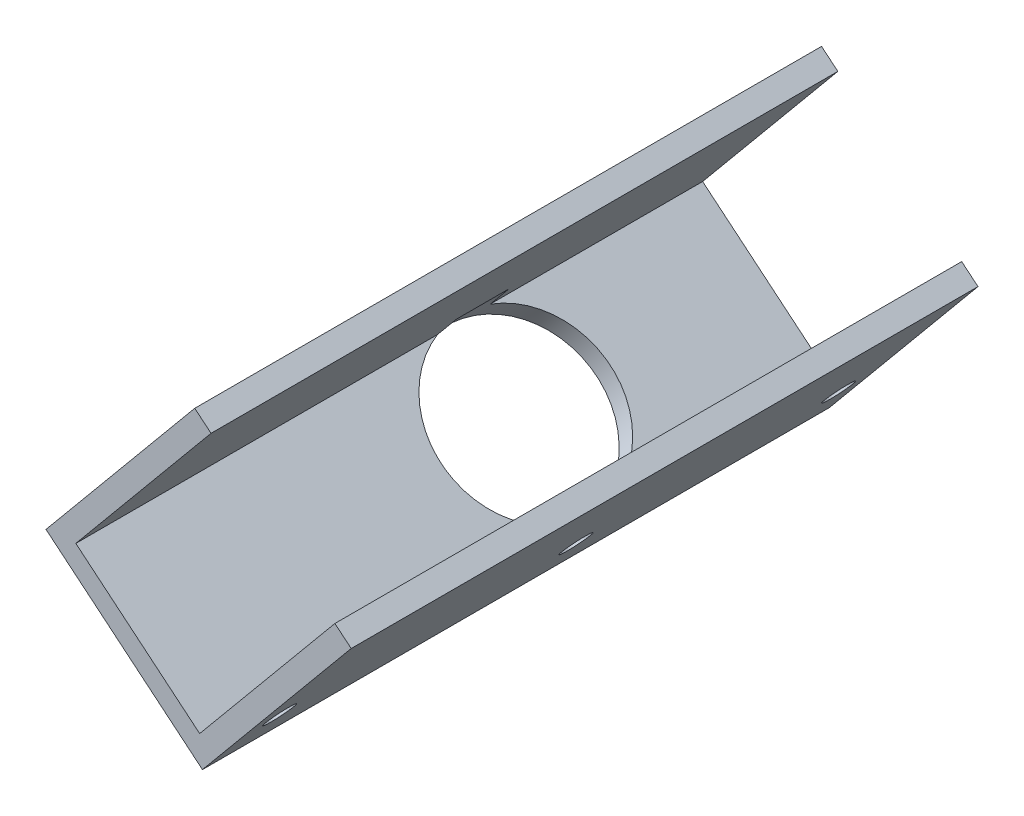
ISO-10303-21;
HEADER;
FILE_DESCRIPTION(('STEP AP214'),'2;1');
FILE_NAME('part.step','',(''),(''),'','','');
FILE_SCHEMA(('AUTOMOTIVE_DESIGN { 1 0 10303 214 1 1 1 1 }'));
ENDSEC;
DATA;
#1=APPLICATION_CONTEXT('core data for automotive mechanical design processes');
#2=APPLICATION_PROTOCOL_DEFINITION('international standard','automotive_design',2000,#1);
#3=PRODUCT_CONTEXT('',#1,'mechanical');
#4=PRODUCT('Part','Part','',(#3));
#5=PRODUCT_RELATED_PRODUCT_CATEGORY('part','',(#4));
#6=PRODUCT_DEFINITION_FORMATION('','',#4);
#7=PRODUCT_DEFINITION_CONTEXT('part definition',#1,'design');
#8=PRODUCT_DEFINITION('design','',#6,#7);
#9=PRODUCT_DEFINITION_SHAPE('','',#8);
#10=(LENGTH_UNIT() NAMED_UNIT(*) SI_UNIT(.MILLI.,.METRE.));
#11=(NAMED_UNIT(*) PLANE_ANGLE_UNIT() SI_UNIT($,.RADIAN.));
#12=(NAMED_UNIT(*) SI_UNIT($,.STERADIAN.) SOLID_ANGLE_UNIT());
#13=UNCERTAINTY_MEASURE_WITH_UNIT(LENGTH_MEASURE(1.E-05),#10,'distance_accuracy_value','');
#14=(GEOMETRIC_REPRESENTATION_CONTEXT(3) GLOBAL_UNCERTAINTY_ASSIGNED_CONTEXT((#13)) GLOBAL_UNIT_ASSIGNED_CONTEXT((#10,
#11,#12)) REPRESENTATION_CONTEXT('',''));
#15=CARTESIAN_POINT('',(0.,0.,0.));
#16=DIRECTION('',(0.,0.,1.));
#17=DIRECTION('',(1.,0.,0.));
#18=AXIS2_PLACEMENT_3D('',#15,#16,#17);
#19=CARTESIAN_POINT('',(-14.6219806697099,12.1325051532909,-37.));
#20=DIRECTION('',(-0.638552902804786,-0.76957792998473,0.));
#21=DIRECTION('',(0.76957792998473,-0.638552902804786,0.));
#22=AXIS2_PLACEMENT_3D('',#19,#20,#21);
#23=PLANE('',#22);
#24=DIRECTION('',(0.,0.,1.));
#25=VECTOR('',#24,1.);
#26=CARTESIAN_POINT('',(0.,0.,-37.));
#27=LINE('',#26,#25);
#28=CARTESIAN_POINT('',(0.,0.,-5.68906456410955));
#29=VERTEX_POINT('',#28);
#30=CARTESIAN_POINT('',(0.,0.,37.));
#31=VERTEX_POINT('',#30);
#32=EDGE_CURVE('E169',#29,#31,#27,.T.);
#33=ORIENTED_EDGE('',*,*,#32,.F.);
#34=CARTESIAN_POINT('',(-7.31099033485493,6.06625257664547,-8.81156356330876));
#35=DIRECTION('',(-0.638552902804786,-0.76957792998473,0.));
#36=DIRECTION('',(0.76957792998473,-0.638552902804786,0.));
#37=AXIS2_PLACEMENT_3D('',#34,#35,#36);
#38=CIRCLE('',#37,10.);
#39=CARTESIAN_POINT('',(-14.6219806697099,12.1325051532909,-5.68906456410954));
#40=VERTEX_POINT('',#39);
#41=EDGE_CURVE('E197',#29,#40,#38,.T.);
#42=ORIENTED_EDGE('',*,*,#41,.T.);
#43=DIRECTION('',(0.,0.,1.));
#44=VECTOR('',#43,1.);
#45=CARTESIAN_POINT('',(-14.6219806697099,12.1325051532909,-37.));
#46=LINE('',#45,#44);
#47=CARTESIAN_POINT('',(-14.6219806697099,12.1325051532909,37.));
#48=VERTEX_POINT('',#47);
#49=EDGE_CURVE('E182',#40,#48,#46,.T.);
#50=ORIENTED_EDGE('',*,*,#49,.T.);
#51=DIRECTION('',(0.76957792998473,-0.638552902804786,0.));
#52=VECTOR('',#51,1.);
#53=CARTESIAN_POINT('',(-14.6219806697099,12.1325051532909,37.));
#54=LINE('',#53,#52);
#55=EDGE_CURVE('E200',#48,#31,#54,.T.);
#56=ORIENTED_EDGE('',*,*,#55,.T.);
#57=EDGE_LOOP('',(#33,#42,#50,#56));
#58=FACE_BOUND('',#57,.T.);
#59=ADVANCED_FACE('F40',(#58),#23,.F.);
#60=CARTESIAN_POINT('',(1.92394482496182,-1.59638225701197,-37.));
#61=DIRECTION('',(0.76957792998473,-0.638552902804786,0.));
#62=DIRECTION('',(0.638552902804786,0.76957792998473,0.));
#63=AXIS2_PLACEMENT_3D('',#60,#61,#62);
#64=PLANE('',#63);
#65=DIRECTION('',(0.,0.,-1.));
#66=VECTOR('',#65,1.);
#67=CARTESIAN_POINT('',(17.8877673950815,17.6430659926063,-37.));
#68=LINE('',#67,#66);
#69=CARTESIAN_POINT('',(17.8877673950815,17.6430659926063,37.));
#70=VERTEX_POINT('',#69);
#71=CARTESIAN_POINT('',(17.8877673950815,17.6430659926063,-37.));
#72=VERTEX_POINT('',#71);
#73=EDGE_CURVE('E127',#70,#72,#68,.T.);
#74=ORIENTED_EDGE('',*,*,#73,.F.);
#75=DIRECTION('',(0.638552902804786,0.76957792998473,0.));
#76=VECTOR('',#75,1.);
#77=CARTESIAN_POINT('',(1.92394482496182,-1.59638225701197,37.));
#78=LINE('',#77,#76);
#79=CARTESIAN_POINT('',(0.327562567949858,-3.52032708197379,37.));
#80=VERTEX_POINT('',#79);
#81=EDGE_CURVE('E138',#80,#70,#78,.T.);
#82=ORIENTED_EDGE('',*,*,#81,.F.);
#83=DIRECTION('',(0.,0.,1.));
#84=VECTOR('',#83,1.);
#85=CARTESIAN_POINT('',(0.327562567949858,-3.52032708197379,-37.));
#86=LINE('',#85,#84);
#87=CARTESIAN_POINT('',(0.327562567949858,-3.52032708197379,-37.));
#88=VERTEX_POINT('',#87);
#89=EDGE_CURVE('E170',#88,#80,#86,.T.);
#90=ORIENTED_EDGE('',*,*,#89,.F.);
#91=DIRECTION('',(0.638552902804786,0.76957792998473,0.));
#92=VECTOR('',#91,1.);
#93=CARTESIAN_POINT('',(1.92394482496182,-1.59638225701197,-37.));
#94=LINE('',#93,#92);
#95=EDGE_CURVE('E140',#88,#72,#94,.T.);
#96=ORIENTED_EDGE('',*,*,#95,.T.);
#97=EDGE_LOOP('',(#74,#82,#90,#96));
#98=FACE_BOUND('',#97,.T.);
#99=CARTESIAN_POINT('',(5.43598579038817,2.63629635790407,33.0000000000001));
#100=DIRECTION('',(0.76957792998473,-0.638552902804786,0.));
#101=DIRECTION('',(0.638552902804786,0.76957792998473,0.));
#102=AXIS2_PLACEMENT_3D('',#99,#100,#101);
#103=CIRCLE('',#102,1.69999999999999);
#104=CARTESIAN_POINT('',(6.5215257251563,3.9445788388781,33.0000000000001));
#105=VERTEX_POINT('',#104);
#106=EDGE_CURVE('E241',#105,#105,#103,.T.);
#107=ORIENTED_EDGE('',*,*,#106,.F.);
#108=EDGE_LOOP('',(#107));
#109=FACE_BOUND('',#108,.T.);
#110=CARTESIAN_POINT('',(5.43598579038815,2.63629635790404,-32.9999999999999));
#111=DIRECTION('',(0.76957792998473,-0.638552902804786,0.));
#112=DIRECTION('',(0.638552902804786,0.76957792998473,0.));
#113=AXIS2_PLACEMENT_3D('',#110,#111,#112);
#114=CIRCLE('',#113,1.69999999999999);
#115=CARTESIAN_POINT('',(6.52152572515628,3.94457883887808,-32.9999999999999));
#116=VERTEX_POINT('',#115);
#117=EDGE_CURVE('E238',#116,#116,#114,.T.);
#118=ORIENTED_EDGE('',*,*,#117,.F.);
#119=EDGE_LOOP('',(#118));
#120=FACE_BOUND('',#119,.T.);
#121=CARTESIAN_POINT('',(5.43598579038817,2.63629635790407,-1.99999999999988));
#122=DIRECTION('',(0.76957792998473,-0.638552902804786,0.));
#123=DIRECTION('',(0.638552902804786,0.76957792998473,0.));
#124=AXIS2_PLACEMENT_3D('',#121,#122,#123);
#125=CIRCLE('',#124,1.7);
#126=CARTESIAN_POINT('',(6.5215257251563,3.9445788388781,-1.99999999999988));
#127=VERTEX_POINT('',#126);
#128=EDGE_CURVE('E230',#127,#127,#125,.T.);
#129=ORIENTED_EDGE('',*,*,#128,.F.);
#130=EDGE_LOOP('',(#129));
#131=FACE_BOUND('',#130,.T.);
#132=ADVANCED_FACE('F136',(#98,#109,#120,#131),#64,.T.);
#133=CARTESIAN_POINT('',(-16.2183629267218,10.2085603283291,-37.));
#134=DIRECTION('',(-0.638552902804786,-0.76957792998473,0.));
#135=DIRECTION('',(0.76957792998473,-0.638552902804786,0.));
#136=AXIS2_PLACEMENT_3D('',#133,#134,#135);
#137=PLANE('',#136);
#138=CARTESIAN_POINT('',(-8.9073725918669,4.14230775168365,-8.81156356330876));
#139=DIRECTION('',(-0.638552902804786,-0.76957792998473,0.));
#140=DIRECTION('',(0.76957792998473,-0.638552902804786,0.));
#141=AXIS2_PLACEMENT_3D('',#138,#139,#140);
#142=CIRCLE('',#141,10.);
#143=CARTESIAN_POINT('',(-1.2115932920196,-2.24322127636422,-8.81156356330876));
#144=VERTEX_POINT('',#143);
#145=EDGE_CURVE('E244',#144,#144,#142,.T.);
#146=ORIENTED_EDGE('',*,*,#145,.F.);
#147=EDGE_LOOP('',(#146));
#148=FACE_BOUND('',#147,.T.);
#149=ORIENTED_EDGE('',*,*,#89,.T.);
#150=DIRECTION('',(0.76957792998473,-0.638552902804786,0.));
#151=VECTOR('',#150,1.);
#152=CARTESIAN_POINT('',(-16.2183629267218,10.2085603283291,37.));
#153=LINE('',#152,#151);
#154=CARTESIAN_POINT('',(-18.1423077516836,11.8049425853411,37.));
#155=VERTEX_POINT('',#154);
#156=EDGE_CURVE('E147',#155,#80,#153,.T.);
#157=ORIENTED_EDGE('',*,*,#156,.F.);
#158=DIRECTION('',(0.,0.,1.));
#159=VECTOR('',#158,1.);
#160=CARTESIAN_POINT('',(-18.1423077516836,11.8049425853411,-37.));
#161=LINE('',#160,#159);
#162=CARTESIAN_POINT('',(-18.1423077516836,11.8049425853411,-37.));
#163=VERTEX_POINT('',#162);
#164=EDGE_CURVE('E173',#163,#155,#161,.T.);
#165=ORIENTED_EDGE('',*,*,#164,.F.);
#166=DIRECTION('',(0.76957792998473,-0.638552902804786,0.));
#167=VECTOR('',#166,1.);
#168=CARTESIAN_POINT('',(-16.2183629267218,10.2085603283291,-37.));
#169=LINE('',#168,#167);
#170=EDGE_CURVE('E165',#163,#88,#169,.T.);
#171=ORIENTED_EDGE('',*,*,#170,.T.);
#172=EDGE_LOOP('',(#149,#157,#165,#171));
#173=FACE_BOUND('',#172,.T.);
#174=ADVANCED_FACE('F217',(#148,#173),#137,.T.);
#175=CARTESIAN_POINT('',(-0.582102924552028,32.9683356599212,-37.));
#176=DIRECTION('',(-0.76957792998473,0.638552902804786,0.));
#177=DIRECTION('',(-0.638552902804786,-0.76957792998473,0.));
#178=AXIS2_PLACEMENT_3D('',#175,#176,#177);
#179=PLANE('',#178);
#180=ORIENTED_EDGE('',*,*,#164,.T.);
#181=DIRECTION('',(-0.638552902804786,-0.76957792998473,0.));
#182=VECTOR('',#181,1.);
#183=CARTESIAN_POINT('',(-0.582102924552028,32.9683356599212,37.));
#184=LINE('',#183,#182);
#185=CARTESIAN_POINT('',(-0.582102924552028,32.9683356599212,37.));
#186=VERTEX_POINT('',#185);
#187=EDGE_CURVE('E153',#186,#155,#184,.T.);
#188=ORIENTED_EDGE('',*,*,#187,.F.);
#189=DIRECTION('',(0.,0.,1.));
#190=VECTOR('',#189,1.);
#191=CARTESIAN_POINT('',(-0.582102924552028,32.9683356599212,-37.));
#192=LINE('',#191,#190);
#193=CARTESIAN_POINT('',(-0.582102924552028,32.9683356599212,-37.));
#194=VERTEX_POINT('',#193);
#195=EDGE_CURVE('E175',#194,#186,#192,.T.);
#196=ORIENTED_EDGE('',*,*,#195,.F.);
#197=DIRECTION('',(-0.638552902804786,-0.76957792998473,0.));
#198=VECTOR('',#197,1.);
#199=CARTESIAN_POINT('',(-0.582102924552028,32.9683356599212,-37.));
#200=LINE('',#199,#198);
#201=EDGE_CURVE('E162',#194,#163,#200,.T.);
#202=ORIENTED_EDGE('',*,*,#201,.T.);
#203=EDGE_LOOP('',(#180,#188,#196,#202));
#204=FACE_BOUND('',#203,.T.);
#205=ADVANCED_FACE('F298',(#204),#179,.T.);
#206=CARTESIAN_POINT('',(-0.582102924552028,32.9683356599212,-37.));
#207=DIRECTION('',(-0.638552902804787,-0.769577929984729,0.));
#208=DIRECTION('',(0.769577929984729,-0.638552902804787,0.));
#209=AXIS2_PLACEMENT_3D('',#206,#207,#208);
#210=PLANE('',#209);
#211=ORIENTED_EDGE('',*,*,#195,.T.);
#212=DIRECTION('',(0.769577929984729,-0.638552902804787,0.));
#213=VECTOR('',#212,1.);
#214=CARTESIAN_POINT('',(-0.582102924552028,32.9683356599212,37.));
#215=LINE('',#214,#213);
#216=CARTESIAN_POINT('',(1.3418419004098,31.3719534029092,37.));
#217=VERTEX_POINT('',#216);
#218=EDGE_CURVE('E206',#186,#217,#215,.T.);
#219=ORIENTED_EDGE('',*,*,#218,.T.);
#220=DIRECTION('',(0.,0.,1.));
#221=VECTOR('',#220,1.);
#222=CARTESIAN_POINT('',(1.3418419004098,31.3719534029092,-37.));
#223=LINE('',#222,#221);
#224=CARTESIAN_POINT('',(1.3418419004098,31.3719534029092,-37.));
#225=VERTEX_POINT('',#224);
#226=EDGE_CURVE('E177',#225,#217,#223,.T.);
#227=ORIENTED_EDGE('',*,*,#226,.F.);
#228=DIRECTION('',(0.769577929984729,-0.638552902804787,0.));
#229=VECTOR('',#228,1.);
#230=CARTESIAN_POINT('',(-0.582102924552028,32.9683356599212,-37.));
#231=LINE('',#230,#229);
#232=EDGE_CURVE('E160',#194,#225,#231,.T.);
#233=ORIENTED_EDGE('',*,*,#232,.F.);
#234=EDGE_LOOP('',(#211,#219,#227,#233));
#235=FACE_BOUND('',#234,.T.);
#236=ADVANCED_FACE('F290',(#235),#210,.F.);
#237=CARTESIAN_POINT('',(1.3418419004098,31.3719534029092,-37.));
#238=DIRECTION('',(-0.76957792998473,0.638552902804786,0.));
#239=DIRECTION('',(-0.638552902804786,-0.76957792998473,0.));
#240=AXIS2_PLACEMENT_3D('',#237,#238,#239);
#241=PLANE('',#240);
#242=DIRECTION('',(0.,0.,1.));
#243=VECTOR('',#242,1.);
#244=CARTESIAN_POINT('',(-12.3870455098931,14.8260279082375,-37.));
#245=LINE('',#244,#243);
#246=CARTESIAN_POINT('',(-12.3870455098931,14.8260279082375,-11.934062562508));
#247=VERTEX_POINT('',#246);
#248=CARTESIAN_POINT('',(-12.3870455098931,14.8260279082375,-5.68906456410954));
#249=VERTEX_POINT('',#248);
#250=EDGE_CURVE('E249',#247,#249,#245,.T.);
#251=ORIENTED_EDGE('',*,*,#250,.F.);
#252=DIRECTION('',(-0.638552902804786,-0.769577929984729,0.));
#253=VECTOR('',#252,1.);
#254=CARTESIAN_POINT('',(-12.3870455098931,14.8260279082375,-11.934062562508));
#255=LINE('',#254,#253);
#256=CARTESIAN_POINT('',(-14.6219806697099,12.1325051532909,-11.934062562508));
#257=VERTEX_POINT('',#256);
#258=EDGE_CURVE('E254',#247,#257,#255,.T.);
#259=ORIENTED_EDGE('',*,*,#258,.T.);
#260=CARTESIAN_POINT('',(-14.6219806697099,12.1325051532909,-37.));
#261=VERTEX_POINT('',#260);
#262=EDGE_CURVE('E179',#261,#257,#46,.T.);
#263=ORIENTED_EDGE('',*,*,#262,.F.);
#264=DIRECTION('',(-0.638552902804786,-0.76957792998473,0.));
#265=VECTOR('',#264,1.);
#266=CARTESIAN_POINT('',(1.3418419004098,31.3719534029092,-37.));
#267=LINE('',#266,#265);
#268=EDGE_CURVE('E158',#225,#261,#267,.T.);
#269=ORIENTED_EDGE('',*,*,#268,.F.);
#270=ORIENTED_EDGE('',*,*,#226,.T.);
#271=DIRECTION('',(-0.638552902804786,-0.76957792998473,0.));
#272=VECTOR('',#271,1.);
#273=CARTESIAN_POINT('',(1.3418419004098,31.3719534029092,37.));
#274=LINE('',#273,#272);
#275=EDGE_CURVE('E203',#217,#48,#274,.T.);
#276=ORIENTED_EDGE('',*,*,#275,.T.);
#277=ORIENTED_EDGE('',*,*,#49,.F.);
#278=DIRECTION('',(-0.638552902804786,-0.769577929984729,0.));
#279=VECTOR('',#278,1.);
#280=CARTESIAN_POINT('',(-12.3870455098931,14.8260279082375,-5.68906456410954));
#281=LINE('',#280,#279);
#282=EDGE_CURVE('E208',#40,#249,#281,.F.);
#283=ORIENTED_EDGE('',*,*,#282,.T.);
#284=EDGE_LOOP('',(#251,#259,#263,#269,#270,#276,#277,#283));
#285=FACE_BOUND('',#284,.T.);
#286=ADVANCED_FACE('F259',(#285),#241,.F.);
#287=ORIENTED_EDGE('',*,*,#262,.T.);
#288=CARTESIAN_POINT('',(0.,0.,-11.934062562508));
#289=VERTEX_POINT('',#288);
#290=EDGE_CURVE('E251',#257,#289,#38,.T.);
#291=ORIENTED_EDGE('',*,*,#290,.T.);
#292=CARTESIAN_POINT('',(0.,0.,-37.));
#293=VERTEX_POINT('',#292);
#294=EDGE_CURVE('E183',#293,#289,#27,.T.);
#295=ORIENTED_EDGE('',*,*,#294,.F.);
#296=DIRECTION('',(0.76957792998473,-0.638552902804786,0.));
#297=VECTOR('',#296,1.);
#298=CARTESIAN_POINT('',(-14.6219806697099,12.1325051532909,-37.));
#299=LINE('',#298,#297);
#300=EDGE_CURVE('E151',#261,#293,#299,.T.);
#301=ORIENTED_EDGE('',*,*,#300,.F.);
#302=EDGE_LOOP('',(#287,#291,#295,#301));
#303=FACE_BOUND('',#302,.T.);
#304=ADVANCED_FACE('F277',(#303),#23,.F.);
#305=CARTESIAN_POINT('',(0.,0.,-37.));
#306=DIRECTION('',(0.76957792998473,-0.638552902804786,0.));
#307=DIRECTION('',(0.638552902804786,0.76957792998473,0.));
#308=AXIS2_PLACEMENT_3D('',#305,#306,#307);
#309=PLANE('',#308);
#310=CARTESIAN_POINT('',(3.51204096542634,4.23267861491604,33.0000000000001));
#311=DIRECTION('',(-0.76957792998473,0.638552902804786,0.));
#312=DIRECTION('',(-0.638552902804786,-0.76957792998473,0.));
#313=AXIS2_PLACEMENT_3D('',#310,#311,#312);
#314=CIRCLE('',#313,1.69999999999999);
#315=CARTESIAN_POINT('',(2.42650103065821,2.924396133942,33.0000000000001));
#316=VERTEX_POINT('',#315);
#317=EDGE_CURVE('E227',#316,#316,#314,.T.);
#318=ORIENTED_EDGE('',*,*,#317,.F.);
#319=EDGE_LOOP('',(#318));
#320=FACE_BOUND('',#319,.T.);
#321=CARTESIAN_POINT('',(3.51204096542632,4.23267861491601,-32.9999999999999));
#322=DIRECTION('',(-0.76957792998473,0.638552902804786,0.));
#323=DIRECTION('',(-0.638552902804786,-0.76957792998473,0.));
#324=AXIS2_PLACEMENT_3D('',#321,#322,#323);
#325=CIRCLE('',#324,1.69999999999999);
#326=CARTESIAN_POINT('',(2.42650103065819,2.92439613394198,-32.9999999999999));
#327=VERTEX_POINT('',#326);
#328=EDGE_CURVE('E231',#327,#327,#325,.T.);
#329=ORIENTED_EDGE('',*,*,#328,.F.);
#330=EDGE_LOOP('',(#329));
#331=FACE_BOUND('',#330,.T.);
#332=CARTESIAN_POINT('',(3.51204096542634,4.23267861491603,-1.99999999999988));
#333=DIRECTION('',(-0.76957792998473,0.638552902804786,0.));
#334=DIRECTION('',(-0.638552902804786,-0.76957792998473,0.));
#335=AXIS2_PLACEMENT_3D('',#332,#333,#334);
#336=CIRCLE('',#335,1.7);
#337=CARTESIAN_POINT('',(2.42650103065821,2.924396133942,-1.99999999999988));
#338=VERTEX_POINT('',#337);
#339=EDGE_CURVE('E141',#338,#338,#336,.T.);
#340=ORIENTED_EDGE('',*,*,#339,.F.);
#341=EDGE_LOOP('',(#340));
#342=FACE_BOUND('',#341,.T.);
#343=DIRECTION('',(0.638552902804786,0.76957792998473,0.));
#344=VECTOR('',#343,1.);
#345=CARTESIAN_POINT('',(0.,0.,37.));
#346=LINE('',#345,#344);
#347=CARTESIAN_POINT('',(15.9638225701196,19.2394482496182,37.));
#348=VERTEX_POINT('',#347);
#349=EDGE_CURVE('E204',#31,#348,#346,.T.);
#350=ORIENTED_EDGE('',*,*,#349,.T.);
#351=DIRECTION('',(0.,0.,-1.));
#352=VECTOR('',#351,1.);
#353=CARTESIAN_POINT('',(15.9638225701197,19.2394482496182,-37.));
#354=LINE('',#353,#352);
#355=CARTESIAN_POINT('',(15.9638225701197,19.2394482496182,-37.));
#356=VERTEX_POINT('',#355);
#357=EDGE_CURVE('E55',#348,#356,#354,.T.);
#358=ORIENTED_EDGE('',*,*,#357,.T.);
#359=DIRECTION('',(0.638552902804786,0.76957792998473,0.));
#360=VECTOR('',#359,1.);
#361=CARTESIAN_POINT('',(0.,0.,-37.));
#362=LINE('',#361,#360);
#363=EDGE_CURVE('E148',#293,#356,#362,.T.);
#364=ORIENTED_EDGE('',*,*,#363,.F.);
#365=ORIENTED_EDGE('',*,*,#294,.T.);
#366=DIRECTION('',(-0.638552902804786,-0.769577929984729,0.));
#367=VECTOR('',#366,1.);
#368=CARTESIAN_POINT('',(2.23493515981675,2.69352275494655,-11.934062562508));
#369=LINE('',#368,#367);
#370=CARTESIAN_POINT('',(2.23493515981675,2.69352275494655,-11.934062562508));
#371=VERTEX_POINT('',#370);
#372=EDGE_CURVE('E187',#289,#371,#369,.F.);
#373=ORIENTED_EDGE('',*,*,#372,.T.);
#374=DIRECTION('',(0.,0.,-1.));
#375=VECTOR('',#374,1.);
#376=CARTESIAN_POINT('',(2.23493515981675,2.69352275494655,-37.));
#377=LINE('',#376,#375);
#378=CARTESIAN_POINT('',(2.23493515981675,2.69352275494655,-5.68906456410955));
#379=VERTEX_POINT('',#378);
#380=EDGE_CURVE('E172',#379,#371,#377,.T.);
#381=ORIENTED_EDGE('',*,*,#380,.F.);
#382=DIRECTION('',(-0.638552902804786,-0.769577929984729,0.));
#383=VECTOR('',#382,1.);
#384=CARTESIAN_POINT('',(2.23493515981675,2.69352275494655,-5.68906456410955));
#385=LINE('',#384,#383);
#386=EDGE_CURVE('E48',#379,#29,#385,.T.);
#387=ORIENTED_EDGE('',*,*,#386,.T.);
#388=ORIENTED_EDGE('',*,*,#32,.T.);
#389=EDGE_LOOP('',(#350,#358,#364,#365,#373,#381,#387,#388));
#390=FACE_BOUND('',#389,.T.);
#391=ADVANCED_FACE('F42',(#320,#331,#342,#390),#309,.F.);
#392=CARTESIAN_POINT('',(100.821605792765,76.8183230910163,-37.));
#393=DIRECTION('',(0.,0.,-1.));
#394=DIRECTION('',(-1.,0.,0.));
#395=AXIS2_PLACEMENT_3D('',#392,#393,#394);
#396=PLANE('',#395);
#397=DIRECTION('',(0.769577929984729,-0.638552902804787,0.));
#398=VECTOR('',#397,1.);
#399=CARTESIAN_POINT('',(1.3418419004098,31.3719534029092,-37.));
#400=LINE('',#399,#398);
#401=EDGE_CURVE('E222',#356,#72,#400,.T.);
#402=ORIENTED_EDGE('',*,*,#401,.T.);
#403=ORIENTED_EDGE('',*,*,#95,.F.);
#404=ORIENTED_EDGE('',*,*,#170,.F.);
#405=ORIENTED_EDGE('',*,*,#201,.F.);
#406=ORIENTED_EDGE('',*,*,#232,.T.);
#407=ORIENTED_EDGE('',*,*,#268,.T.);
#408=ORIENTED_EDGE('',*,*,#300,.T.);
#409=ORIENTED_EDGE('',*,*,#363,.T.);
#410=EDGE_LOOP('',(#402,#403,#404,#405,#406,#407,#408,#409));
#411=FACE_BOUND('',#410,.T.);
#412=ADVANCED_FACE('F220',(#411),#396,.T.);
#413=CARTESIAN_POINT('',(100.821605792765,76.8183230910163,37.));
#414=DIRECTION('',(0.,0.,-1.));
#415=DIRECTION('',(-1.,0.,0.));
#416=AXIS2_PLACEMENT_3D('',#413,#414,#415);
#417=PLANE('',#416);
#418=ORIENTED_EDGE('',*,*,#81,.T.);
#419=DIRECTION('',(-0.769577929984729,0.638552902804787,0.));
#420=VECTOR('',#419,1.);
#421=CARTESIAN_POINT('',(37.925667742568,1.01673234338837,37.));
#422=LINE('',#421,#420);
#423=EDGE_CURVE('E11',#70,#348,#422,.T.);
#424=ORIENTED_EDGE('',*,*,#423,.T.);
#425=ORIENTED_EDGE('',*,*,#349,.F.);
#426=ORIENTED_EDGE('',*,*,#55,.F.);
#427=ORIENTED_EDGE('',*,*,#275,.F.);
#428=ORIENTED_EDGE('',*,*,#218,.F.);
#429=ORIENTED_EDGE('',*,*,#187,.T.);
#430=ORIENTED_EDGE('',*,*,#156,.T.);
#431=EDGE_LOOP('',(#418,#424,#425,#426,#427,#428,#429,#430));
#432=FACE_BOUND('',#431,.T.);
#433=ADVANCED_FACE('F144',(#432),#417,.F.);
#434=CARTESIAN_POINT('',(-5.07605517503818,8.75977533159202,-8.81156356330876));
#435=DIRECTION('',(-0.638552902804786,-0.769577929984729,0.));
#436=DIRECTION('',(0.76957792998473,-0.638552902804786,0.));
#437=AXIS2_PLACEMENT_3D('',#434,#435,#436);
#438=CYLINDRICAL_SURFACE('',#437,10.);
#439=ORIENTED_EDGE('',*,*,#145,.T.);
#440=EDGE_LOOP('',(#439));
#441=FACE_BOUND('',#440,.T.);
#442=ORIENTED_EDGE('',*,*,#41,.F.);
#443=ORIENTED_EDGE('',*,*,#386,.F.);
#444=CARTESIAN_POINT('',(-5.07605517503818,8.75977533159202,-8.81156356330876));
#445=DIRECTION('',(-0.638552902804786,-0.76957792998473,0.));
#446=DIRECTION('',(0.76957792998473,-0.638552902804786,0.));
#447=AXIS2_PLACEMENT_3D('',#444,#445,#446);
#448=CIRCLE('',#447,10.);
#449=EDGE_CURVE('E61',#371,#379,#448,.T.);
#450=ORIENTED_EDGE('',*,*,#449,.F.);
#451=ORIENTED_EDGE('',*,*,#372,.F.);
#452=ORIENTED_EDGE('',*,*,#290,.F.);
#453=ORIENTED_EDGE('',*,*,#258,.F.);
#454=EDGE_CURVE('E246',#249,#247,#448,.T.);
#455=ORIENTED_EDGE('',*,*,#454,.F.);
#456=ORIENTED_EDGE('',*,*,#282,.F.);
#457=EDGE_LOOP('',(#442,#443,#450,#451,#452,#453,#455,#456));
#458=FACE_BOUND('',#457,.T.);
#459=ADVANCED_FACE('F261',(#441,#458),#438,.F.);
#460=CARTESIAN_POINT('',(-5.07605517503818,8.75977533159202,-8.81156356330876));
#461=DIRECTION('',(-0.638552902804786,-0.76957792998473,0.));
#462=DIRECTION('',(0.76957792998473,-0.638552902804786,0.));
#463=AXIS2_PLACEMENT_3D('',#460,#461,#462);
#464=PLANE('',#463);
#465=ORIENTED_EDGE('',*,*,#250,.T.);
#466=ORIENTED_EDGE('',*,*,#454,.T.);
#467=EDGE_LOOP('',(#465,#466));
#468=FACE_BOUND('',#467,.T.);
#469=ADVANCED_FACE('F264',(#468),#464,.T.);
#470=ORIENTED_EDGE('',*,*,#380,.T.);
#471=ORIENTED_EDGE('',*,*,#449,.T.);
#472=EDGE_LOOP('',(#470,#471));
#473=FACE_BOUND('',#472,.T.);
#474=ADVANCED_FACE('F266',(#473),#464,.T.);
#475=CARTESIAN_POINT('',(10.4382423352889,-1.51429751032704,-1.99999999999988));
#476=DIRECTION('',(-0.76957792998473,0.638552902804786,0.));
#477=DIRECTION('',(-0.638552902804786,-0.76957792998473,0.));
#478=AXIS2_PLACEMENT_3D('',#475,#476,#477);
#479=CYLINDRICAL_SURFACE('',#478,1.7);
#480=ORIENTED_EDGE('',*,*,#128,.T.);
#481=EDGE_LOOP('',(#480));
#482=FACE_BOUND('',#481,.T.);
#483=ORIENTED_EDGE('',*,*,#339,.T.);
#484=EDGE_LOOP('',(#483));
#485=FACE_BOUND('',#484,.T.);
#486=ADVANCED_FACE('F272',(#482,#485),#479,.F.);
#487=CARTESIAN_POINT('',(10.4382423352889,-1.51429751032706,-32.9999999999999));
#488=DIRECTION('',(-0.76957792998473,0.638552902804786,0.));
#489=DIRECTION('',(-0.638552902804786,-0.76957792998473,0.));
#490=AXIS2_PLACEMENT_3D('',#487,#488,#489);
#491=CYLINDRICAL_SURFACE('',#490,1.69999999999999);
#492=ORIENTED_EDGE('',*,*,#117,.T.);
#493=EDGE_LOOP('',(#492));
#494=FACE_BOUND('',#493,.T.);
#495=ORIENTED_EDGE('',*,*,#328,.T.);
#496=EDGE_LOOP('',(#495));
#497=FACE_BOUND('',#496,.T.);
#498=ADVANCED_FACE('F344',(#494,#497),#491,.F.);
#499=CARTESIAN_POINT('',(10.4382423352889,-1.51429751032704,33.0000000000001));
#500=DIRECTION('',(-0.76957792998473,0.638552902804786,0.));
#501=DIRECTION('',(-0.638552902804786,-0.76957792998473,0.));
#502=AXIS2_PLACEMENT_3D('',#499,#500,#501);
#503=CYLINDRICAL_SURFACE('',#502,1.69999999999999);
#504=ORIENTED_EDGE('',*,*,#106,.T.);
#505=EDGE_LOOP('',(#504));
#506=FACE_BOUND('',#505,.T.);
#507=ORIENTED_EDGE('',*,*,#317,.T.);
#508=EDGE_LOOP('',(#507));
#509=FACE_BOUND('',#508,.T.);
#510=ADVANCED_FACE('F353',(#506,#509),#503,.F.);
#511=CARTESIAN_POINT('',(1.3418419004098,31.3719534029092,-37.));
#512=DIRECTION('',(-0.638552902804787,-0.769577929984729,0.));
#513=DIRECTION('',(0.769577929984729,-0.638552902804787,0.));
#514=AXIS2_PLACEMENT_3D('',#511,#512,#513);
#515=PLANE('',#514);
#516=ORIENTED_EDGE('',*,*,#73,.T.);
#517=ORIENTED_EDGE('',*,*,#401,.F.);
#518=ORIENTED_EDGE('',*,*,#357,.F.);
#519=ORIENTED_EDGE('',*,*,#423,.F.);
#520=EDGE_LOOP('',(#516,#517,#518,#519));
#521=FACE_BOUND('',#520,.T.);
#522=ADVANCED_FACE('F126',(#521),#515,.F.);
#523=CLOSED_SHELL('',(#59,#132,#174,#205,#236,#286,#304,#391,#412,#433,#459,#469,#474,#486,#498,
#510,#522));
#524=MANIFOLD_SOLID_BREP('B2',#523);
#525=ADVANCED_BREP_SHAPE_REPRESENTATION('',(#18,#524),#14);
#526=SHAPE_DEFINITION_REPRESENTATION(#9,#525);
ENDSEC;
END-ISO-10303-21;
